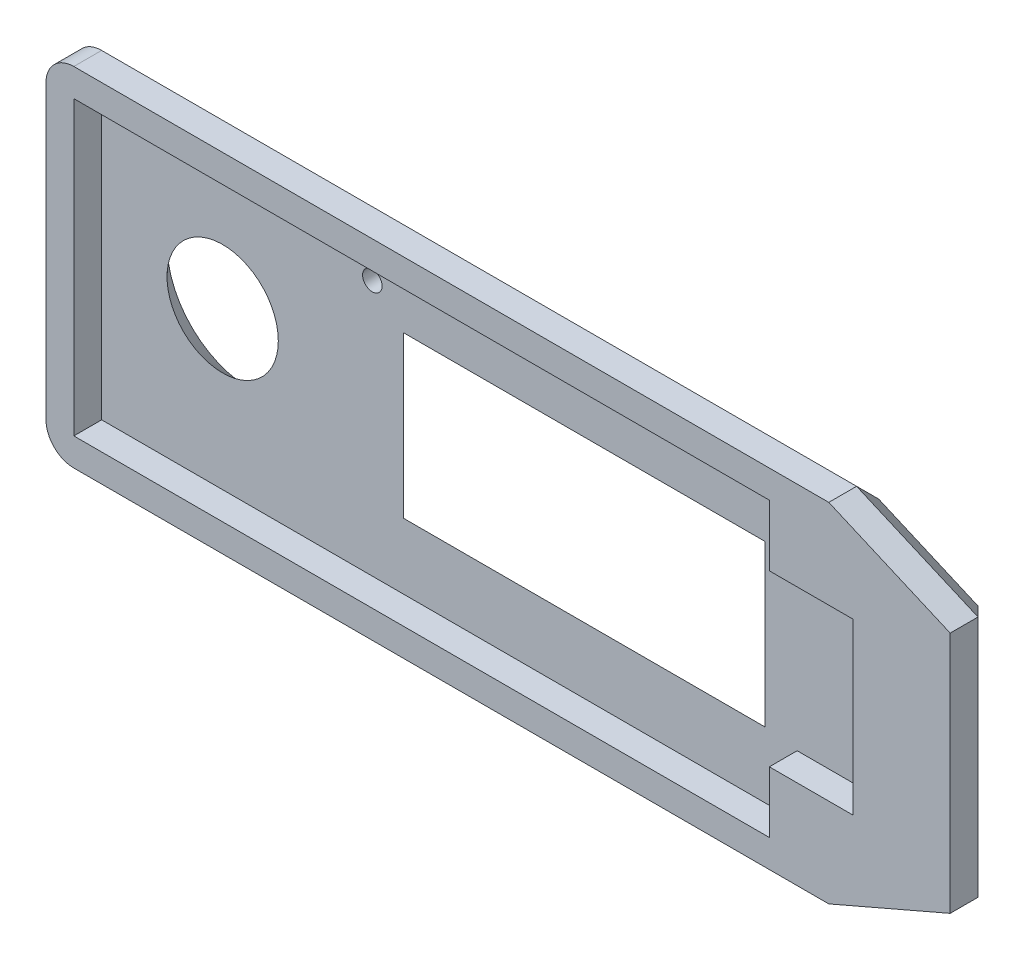
ISO-10303-21;
HEADER;
FILE_DESCRIPTION(('STEP AP214'),'2;1');
FILE_NAME('part.step','',(''),(''),'','','');
FILE_SCHEMA(('AUTOMOTIVE_DESIGN { 1 0 10303 214 1 1 1 1 }'));
ENDSEC;
DATA;
#1=APPLICATION_CONTEXT('core data for automotive mechanical design processes');
#2=APPLICATION_PROTOCOL_DEFINITION('international standard','automotive_design',2000,#1);
#3=PRODUCT_CONTEXT('',#1,'mechanical');
#4=PRODUCT('Part','Part','',(#3));
#5=PRODUCT_RELATED_PRODUCT_CATEGORY('part','',(#4));
#6=PRODUCT_DEFINITION_FORMATION('','',#4);
#7=PRODUCT_DEFINITION_CONTEXT('part definition',#1,'design');
#8=PRODUCT_DEFINITION('design','',#6,#7);
#9=PRODUCT_DEFINITION_SHAPE('','',#8);
#10=(LENGTH_UNIT() NAMED_UNIT(*) SI_UNIT(.MILLI.,.METRE.));
#11=(NAMED_UNIT(*) PLANE_ANGLE_UNIT() SI_UNIT($,.RADIAN.));
#12=(NAMED_UNIT(*) SI_UNIT($,.STERADIAN.) SOLID_ANGLE_UNIT());
#13=UNCERTAINTY_MEASURE_WITH_UNIT(LENGTH_MEASURE(1.E-05),#10,'distance_accuracy_value','');
#14=(GEOMETRIC_REPRESENTATION_CONTEXT(3) GLOBAL_UNCERTAINTY_ASSIGNED_CONTEXT((#13)) GLOBAL_UNIT_ASSIGNED_CONTEXT((#10,
#11,#12)) REPRESENTATION_CONTEXT('',''));
#15=CARTESIAN_POINT('',(0.,0.,0.));
#16=DIRECTION('',(0.,0.,1.));
#17=DIRECTION('',(1.,0.,0.));
#18=AXIS2_PLACEMENT_3D('',#15,#16,#17);
#19=CARTESIAN_POINT('',(-18.703125,13.70078125,2.));
#20=DIRECTION('',(1.,0.,0.));
#21=DIRECTION('',(0.,1.,0.));
#22=AXIS2_PLACEMENT_3D('',#19,#20,#21);
#23=PLANE('',#22);
#24=DIRECTION('',(0.,0.,-1.));
#25=VECTOR('',#24,1.);
#26=CARTESIAN_POINT('',(-18.703125,11.70078125,2.));
#27=LINE('',#26,#25);
#28=CARTESIAN_POINT('',(-18.703125,11.70078125,4.));
#29=VERTEX_POINT('',#28);
#30=CARTESIAN_POINT('',(-18.703125,11.70078125,2.00000000000001));
#31=VERTEX_POINT('',#30);
#32=EDGE_CURVE('E242',#29,#31,#27,.T.);
#33=ORIENTED_EDGE('',*,*,#32,.T.);
#34=DIRECTION('',(0.,-1.,0.));
#35=VECTOR('',#34,1.);
#36=CARTESIAN_POINT('',(-18.703125,13.70078125,2.));
#37=LINE('',#36,#35);
#38=CARTESIAN_POINT('',(-18.703125,-9.29921875,2.));
#39=VERTEX_POINT('',#38);
#40=EDGE_CURVE('E266',#31,#39,#37,.T.);
#41=ORIENTED_EDGE('',*,*,#40,.T.);
#42=DIRECTION('',(0.,0.,-1.));
#43=VECTOR('',#42,1.);
#44=CARTESIAN_POINT('',(-18.703125,-9.29921875,2.));
#45=LINE('',#44,#43);
#46=CARTESIAN_POINT('',(-18.703125,-9.29921875,4.));
#47=VERTEX_POINT('',#46);
#48=EDGE_CURVE('E245',#39,#47,#45,.F.);
#49=ORIENTED_EDGE('',*,*,#48,.T.);
#50=DIRECTION('',(0.,-1.,0.));
#51=VECTOR('',#50,1.);
#52=CARTESIAN_POINT('',(-18.703125,13.70078125,4.));
#53=LINE('',#52,#51);
#54=EDGE_CURVE('E384',#29,#47,#53,.T.);
#55=ORIENTED_EDGE('',*,*,#54,.F.);
#56=EDGE_LOOP('',(#33,#41,#49,#55));
#57=FACE_BOUND('',#56,.T.);
#58=ADVANCED_FACE('F35',(#57),#23,.F.);
#59=CARTESIAN_POINT('',(-18.703125,-11.29921875,2.));
#60=DIRECTION('',(0.,1.,0.));
#61=DIRECTION('',(-1.,0.,0.));
#62=AXIS2_PLACEMENT_3D('',#59,#60,#61);
#63=PLANE('',#62);
#64=DIRECTION('',(0.,0.,-1.));
#65=VECTOR('',#64,1.);
#66=CARTESIAN_POINT('',(-16.703125,-11.29921875,2.));
#67=LINE('',#66,#65);
#68=CARTESIAN_POINT('',(-16.703125,-11.29921875,4.));
#69=VERTEX_POINT('',#68);
#70=CARTESIAN_POINT('',(-16.703125,-11.29921875,2.00000000000001));
#71=VERTEX_POINT('',#70);
#72=EDGE_CURVE('E239',#69,#71,#67,.T.);
#73=ORIENTED_EDGE('',*,*,#72,.T.);
#74=DIRECTION('',(1.,0.,0.));
#75=VECTOR('',#74,1.);
#76=CARTESIAN_POINT('',(-18.703125,-11.29921875,2.));
#77=LINE('',#76,#75);
#78=CARTESIAN_POINT('',(37.5703125,-11.29921875,2.));
#79=VERTEX_POINT('',#78);
#80=EDGE_CURVE('E253',#71,#79,#77,.T.);
#81=ORIENTED_EDGE('',*,*,#80,.T.);
#82=DIRECTION('',(0.,0.,-1.));
#83=VECTOR('',#82,1.);
#84=CARTESIAN_POINT('',(37.5703125,-11.29921875,2.));
#85=LINE('',#84,#83);
#86=CARTESIAN_POINT('',(37.5703125,-11.29921875,4.));
#87=VERTEX_POINT('',#86);
#88=EDGE_CURVE('E409',#87,#79,#85,.T.);
#89=ORIENTED_EDGE('',*,*,#88,.F.);
#90=DIRECTION('',(1.,0.,0.));
#91=VECTOR('',#90,1.);
#92=CARTESIAN_POINT('',(-18.703125,-11.29921875,4.));
#93=LINE('',#92,#91);
#94=EDGE_CURVE('E387',#69,#87,#93,.T.);
#95=ORIENTED_EDGE('',*,*,#94,.F.);
#96=EDGE_LOOP('',(#73,#81,#89,#95));
#97=FACE_BOUND('',#96,.T.);
#98=ADVANCED_FACE('F440',(#97),#63,.F.);
#99=CARTESIAN_POINT('',(46.296875,-7.52421874999999,2.));
#100=DIRECTION('',(-0.397030883570598,0.91780525030703,0.));
#101=DIRECTION('',(-0.91780525030703,-0.397030883570598,0.));
#102=AXIS2_PLACEMENT_3D('',#99,#100,#101);
#103=PLANE('',#102);
#104=ORIENTED_EDGE('',*,*,#88,.T.);
#105=DIRECTION('',(0.91780525030703,0.397030883570598,0.));
#106=VECTOR('',#105,1.);
#107=CARTESIAN_POINT('',(46.296875,-7.52421874999999,2.));
#108=LINE('',#107,#106);
#109=CARTESIAN_POINT('',(46.296875,-7.52421874999999,2.));
#110=VERTEX_POINT('',#109);
#111=EDGE_CURVE('E303',#79,#110,#108,.T.);
#112=ORIENTED_EDGE('',*,*,#111,.T.);
#113=DIRECTION('',(0.,0.,-1.));
#114=VECTOR('',#113,1.);
#115=CARTESIAN_POINT('',(46.296875,-7.52421874999999,2.));
#116=LINE('',#115,#114);
#117=CARTESIAN_POINT('',(46.296875,-7.52421874999999,4.));
#118=VERTEX_POINT('',#117);
#119=EDGE_CURVE('E406',#118,#110,#116,.T.);
#120=ORIENTED_EDGE('',*,*,#119,.F.);
#121=DIRECTION('',(0.91780525030703,0.397030883570598,0.));
#122=VECTOR('',#121,1.);
#123=CARTESIAN_POINT('',(37.5703125,-11.29921875,4.));
#124=LINE('',#123,#122);
#125=EDGE_CURVE('E389',#87,#118,#124,.T.);
#126=ORIENTED_EDGE('',*,*,#125,.F.);
#127=EDGE_LOOP('',(#104,#112,#120,#126));
#128=FACE_BOUND('',#127,.T.);
#129=ADVANCED_FACE('F462',(#128),#103,.F.);
#130=CARTESIAN_POINT('',(46.296875,9.92578124999999,2.));
#131=DIRECTION('',(-1.,0.,0.));
#132=DIRECTION('',(0.,0.,1.));
#133=AXIS2_PLACEMENT_3D('',#130,#131,#132);
#134=PLANE('',#133);
#135=ORIENTED_EDGE('',*,*,#119,.T.);
#136=DIRECTION('',(0.,1.,0.));
#137=VECTOR('',#136,1.);
#138=CARTESIAN_POINT('',(46.296875,9.92578124999999,2.));
#139=LINE('',#138,#137);
#140=CARTESIAN_POINT('',(46.296875,9.92578124999999,2.));
#141=VERTEX_POINT('',#140);
#142=EDGE_CURVE('E300',#110,#141,#139,.T.);
#143=ORIENTED_EDGE('',*,*,#142,.T.);
#144=DIRECTION('',(0.,0.,-1.));
#145=VECTOR('',#144,1.);
#146=CARTESIAN_POINT('',(46.296875,9.92578124999999,2.));
#147=LINE('',#146,#145);
#148=CARTESIAN_POINT('',(46.296875,9.92578124999999,4.));
#149=VERTEX_POINT('',#148);
#150=EDGE_CURVE('E403',#149,#141,#147,.T.);
#151=ORIENTED_EDGE('',*,*,#150,.F.);
#152=DIRECTION('',(0.,1.,0.));
#153=VECTOR('',#152,1.);
#154=CARTESIAN_POINT('',(46.296875,-7.52421874999999,4.));
#155=LINE('',#154,#153);
#156=EDGE_CURVE('E392',#118,#149,#155,.T.);
#157=ORIENTED_EDGE('',*,*,#156,.F.);
#158=EDGE_LOOP('',(#135,#143,#151,#157));
#159=FACE_BOUND('',#158,.T.);
#160=ADVANCED_FACE('F458',(#159),#134,.F.);
#161=CARTESIAN_POINT('',(46.296875,9.92578124999999,2.));
#162=DIRECTION('',(-0.397030883570599,-0.91780525030703,0.));
#163=DIRECTION('',(0.91780525030703,-0.397030883570599,0.));
#164=AXIS2_PLACEMENT_3D('',#161,#162,#163);
#165=PLANE('',#164);
#166=ORIENTED_EDGE('',*,*,#150,.T.);
#167=DIRECTION('',(-0.91780525030703,0.397030883570599,0.));
#168=VECTOR('',#167,1.);
#169=CARTESIAN_POINT('',(46.296875,9.92578124999999,2.));
#170=LINE('',#169,#168);
#171=CARTESIAN_POINT('',(37.5703125,13.70078125,2.));
#172=VERTEX_POINT('',#171);
#173=EDGE_CURVE('E412',#141,#172,#170,.T.);
#174=ORIENTED_EDGE('',*,*,#173,.T.);
#175=DIRECTION('',(0.,0.,-1.));
#176=VECTOR('',#175,1.);
#177=CARTESIAN_POINT('',(37.5703125,13.70078125,2.));
#178=LINE('',#177,#176);
#179=CARTESIAN_POINT('',(37.5703125,13.70078125,4.));
#180=VERTEX_POINT('',#179);
#181=EDGE_CURVE('E401',#180,#172,#178,.T.);
#182=ORIENTED_EDGE('',*,*,#181,.F.);
#183=DIRECTION('',(-0.91780525030703,0.397030883570599,0.));
#184=VECTOR('',#183,1.);
#185=CARTESIAN_POINT('',(46.296875,9.92578124999999,4.));
#186=LINE('',#185,#184);
#187=EDGE_CURVE('E395',#149,#180,#186,.T.);
#188=ORIENTED_EDGE('',*,*,#187,.F.);
#189=EDGE_LOOP('',(#166,#174,#182,#188));
#190=FACE_BOUND('',#189,.T.);
#191=ADVANCED_FACE('F455',(#190),#165,.F.);
#192=CARTESIAN_POINT('',(-18.703125,13.70078125,2.));
#193=DIRECTION('',(0.,-1.,0.));
#194=DIRECTION('',(1.,0.,0.));
#195=AXIS2_PLACEMENT_3D('',#192,#193,#194);
#196=PLANE('',#195);
#197=ORIENTED_EDGE('',*,*,#181,.T.);
#198=DIRECTION('',(-1.,0.,0.));
#199=VECTOR('',#198,1.);
#200=CARTESIAN_POINT('',(-18.703125,13.70078125,2.));
#201=LINE('',#200,#199);
#202=CARTESIAN_POINT('',(-16.703125,13.70078125,2.));
#203=VERTEX_POINT('',#202);
#204=EDGE_CURVE('E45',#172,#203,#201,.T.);
#205=ORIENTED_EDGE('',*,*,#204,.T.);
#206=DIRECTION('',(0.,0.,-1.));
#207=VECTOR('',#206,1.);
#208=CARTESIAN_POINT('',(-16.703125,13.70078125,2.));
#209=LINE('',#208,#207);
#210=CARTESIAN_POINT('',(-16.703125,13.70078125,4.));
#211=VERTEX_POINT('',#210);
#212=EDGE_CURVE('E251',#203,#211,#209,.F.);
#213=ORIENTED_EDGE('',*,*,#212,.T.);
#214=DIRECTION('',(-1.,0.,0.));
#215=VECTOR('',#214,1.);
#216=CARTESIAN_POINT('',(37.5703125,13.70078125,4.));
#217=LINE('',#216,#215);
#218=EDGE_CURVE('E398',#180,#211,#217,.T.);
#219=ORIENTED_EDGE('',*,*,#218,.F.);
#220=EDGE_LOOP('',(#197,#205,#213,#219));
#221=FACE_BOUND('',#220,.T.);
#222=ADVANCED_FACE('F452',(#221),#196,.F.);
#223=CARTESIAN_POINT('',(0.,0.,0.));
#224=DIRECTION('',(0.,0.,1.));
#225=DIRECTION('',(1.,0.,0.));
#226=AXIS2_PLACEMENT_3D('',#223,#224,#225);
#227=PLANE('',#226);
#228=CARTESIAN_POINT('',(-8.00312499999999,1.96785344968988,0.));
#229=DIRECTION('',(0.,0.,1.));
#230=DIRECTION('',(1.,0.,0.));
#231=AXIS2_PLACEMENT_3D('',#228,#229,#230);
#232=CIRCLE('',#231,6.);
#233=CARTESIAN_POINT('',(-2.00312499999999,1.96785344968988,0.));
#234=VERTEX_POINT('',#233);
#235=EDGE_CURVE('E421',#234,#234,#232,.T.);
#236=ORIENTED_EDGE('',*,*,#235,.T.);
#237=EDGE_LOOP('',(#236));
#238=FACE_BOUND('',#237,.T.);
#239=CARTESIAN_POINT('',(2.75687500000002,9.10078125,0.));
#240=DIRECTION('',(0.,0.,1.));
#241=DIRECTION('',(1.,0.,0.));
#242=AXIS2_PLACEMENT_3D('',#239,#240,#241);
#243=CIRCLE('',#242,0.7);
#244=CARTESIAN_POINT('',(3.44562386569782,8.97578125000001,0.));
#245=VERTEX_POINT('',#244);
#246=CARTESIAN_POINT('',(2.99687500000001,8.44320996108906,0.));
#247=VERTEX_POINT('',#246);
#248=EDGE_CURVE('E318',#245,#247,#243,.T.);
#249=ORIENTED_EDGE('',*,*,#248,.T.);
#250=DIRECTION('',(0.,-1.,0.));
#251=VECTOR('',#250,1.);
#252=CARTESIAN_POINT('',(2.99687500000001,0.,0.));
#253=LINE('',#252,#251);
#254=CARTESIAN_POINT('',(2.99687500000002,-6.57421875,0.));
#255=VERTEX_POINT('',#254);
#256=EDGE_CURVE('E419',#247,#255,#253,.T.);
#257=ORIENTED_EDGE('',*,*,#256,.T.);
#258=DIRECTION('',(1.,0.,0.));
#259=VECTOR('',#258,1.);
#260=CARTESIAN_POINT('',(0.,-6.57421875,0.));
#261=LINE('',#260,#259);
#262=CARTESIAN_POINT('',(32.996875,-6.57421875,0.));
#263=VERTEX_POINT('',#262);
#264=EDGE_CURVE('E417',#255,#263,#261,.T.);
#265=ORIENTED_EDGE('',*,*,#264,.T.);
#266=DIRECTION('',(0.,1.,0.));
#267=VECTOR('',#266,1.);
#268=CARTESIAN_POINT('',(32.996875,0.,0.));
#269=LINE('',#268,#267);
#270=CARTESIAN_POINT('',(32.996875,8.97578125000001,0.));
#271=VERTEX_POINT('',#270);
#272=EDGE_CURVE('E415',#263,#271,#269,.T.);
#273=ORIENTED_EDGE('',*,*,#272,.T.);
#274=DIRECTION('',(-1.,0.,0.));
#275=VECTOR('',#274,1.);
#276=CARTESIAN_POINT('',(0.,8.97578125000001,0.));
#277=LINE('',#276,#275);
#278=EDGE_CURVE('E223',#271,#245,#277,.T.);
#279=ORIENTED_EDGE('',*,*,#278,.T.);
#280=EDGE_LOOP('',(#249,#257,#265,#273,#279));
#281=FACE_BOUND('',#280,.T.);
#282=DIRECTION('',(-0.91780525030703,-0.397030883570598,0.));
#283=VECTOR('',#282,1.);
#284=CARTESIAN_POINT('',(9.24568068188183,-21.3729828676779,0.));
#285=LINE('',#284,#283);
#286=CARTESIAN_POINT('',(44.296875,-6.21028179828241,0.));
#287=VERTEX_POINT('',#286);
#288=CARTESIAN_POINT('',(37.1562653661662,-9.29921874999999,0.));
#289=VERTEX_POINT('',#288);
#290=EDGE_CURVE('E305',#287,#289,#285,.T.);
#291=ORIENTED_EDGE('',*,*,#290,.T.);
#292=DIRECTION('',(-1.,0.,0.));
#293=VECTOR('',#292,1.);
#294=CARTESIAN_POINT('',(0.,-9.29921874999998,0.));
#295=LINE('',#294,#293);
#296=CARTESIAN_POINT('',(-16.703125,-9.29921875,0.));
#297=VERTEX_POINT('',#296);
#298=EDGE_CURVE('E262',#289,#297,#295,.T.);
#299=ORIENTED_EDGE('',*,*,#298,.T.);
#300=DIRECTION('',(0.,1.,0.));
#301=VECTOR('',#300,1.);
#302=CARTESIAN_POINT('',(-16.703125,0.,0.));
#303=LINE('',#302,#301);
#304=CARTESIAN_POINT('',(-16.703125,11.70078125,0.));
#305=VERTEX_POINT('',#304);
#306=EDGE_CURVE('E260',#297,#305,#303,.T.);
#307=ORIENTED_EDGE('',*,*,#306,.T.);
#308=DIRECTION('',(1.,0.,0.));
#309=VECTOR('',#308,1.);
#310=CARTESIAN_POINT('',(0.,11.70078125,0.));
#311=LINE('',#310,#309);
#312=CARTESIAN_POINT('',(37.1562653661661,11.70078125,0.));
#313=VERTEX_POINT('',#312);
#314=EDGE_CURVE('E258',#305,#313,#311,.T.);
#315=ORIENTED_EDGE('',*,*,#314,.T.);
#316=DIRECTION('',(0.91780525030703,-0.397030883570599,0.));
#317=VECTOR('',#316,1.);
#318=CARTESIAN_POINT('',(10.1208029229807,23.3959786112778,0.));
#319=LINE('',#318,#317);
#320=CARTESIAN_POINT('',(44.296875,8.61184429828241,0.));
#321=VERTEX_POINT('',#320);
#322=EDGE_CURVE('E292',#313,#321,#319,.T.);
#323=ORIENTED_EDGE('',*,*,#322,.T.);
#324=DIRECTION('',(0.,-1.,0.));
#325=VECTOR('',#324,1.);
#326=CARTESIAN_POINT('',(44.296875,0.,0.));
#327=LINE('',#326,#325);
#328=EDGE_CURVE('E301',#321,#287,#327,.T.);
#329=ORIENTED_EDGE('',*,*,#328,.T.);
#330=EDGE_LOOP('',(#291,#299,#307,#315,#323,#329));
#331=FACE_BOUND('',#330,.T.);
#332=ADVANCED_FACE('F291',(#238,#281,#331),#227,.F.);
#333=CARTESIAN_POINT('',(0.,0.,4.));
#334=DIRECTION('',(0.,0.,1.));
#335=DIRECTION('',(1.,0.,0.));
#336=AXIS2_PLACEMENT_3D('',#333,#334,#335);
#337=PLANE('',#336);
#338=ORIENTED_EDGE('',*,*,#54,.T.);
#339=CARTESIAN_POINT('',(-16.703125,-9.29921875,4.));
#340=DIRECTION('',(0.,0.,1.));
#341=DIRECTION('',(1.,0.,0.));
#342=AXIS2_PLACEMENT_3D('',#339,#340,#341);
#343=CIRCLE('',#342,2.);
#344=EDGE_CURVE('E249',#47,#69,#343,.T.);
#345=ORIENTED_EDGE('',*,*,#344,.T.);
#346=ORIENTED_EDGE('',*,*,#94,.T.);
#347=ORIENTED_EDGE('',*,*,#125,.T.);
#348=ORIENTED_EDGE('',*,*,#156,.T.);
#349=ORIENTED_EDGE('',*,*,#187,.T.);
#350=ORIENTED_EDGE('',*,*,#218,.T.);
#351=CARTESIAN_POINT('',(-16.703125,11.70078125,4.));
#352=DIRECTION('',(0.,0.,1.));
#353=DIRECTION('',(1.,0.,0.));
#354=AXIS2_PLACEMENT_3D('',#351,#352,#353);
#355=CIRCLE('',#354,2.);
#356=EDGE_CURVE('E247',#211,#29,#355,.T.);
#357=ORIENTED_EDGE('',*,*,#356,.T.);
#358=EDGE_LOOP('',(#338,#345,#346,#347,#348,#349,#350,#357));
#359=FACE_BOUND('',#358,.T.);
#360=DIRECTION('',(1.,0.,0.));
#361=VECTOR('',#360,1.);
#362=CARTESIAN_POINT('',(-16.703125,-9.29921875,4.));
#363=LINE('',#362,#361);
#364=CARTESIAN_POINT('',(-16.703125,-9.29921875,4.));
#365=VERTEX_POINT('',#364);
#366=CARTESIAN_POINT('',(33.296875,-9.29921875,4.));
#367=VERTEX_POINT('',#366);
#368=EDGE_CURVE('E328',#365,#367,#363,.T.);
#369=ORIENTED_EDGE('',*,*,#368,.F.);
#370=DIRECTION('',(0.,-1.,0.));
#371=VECTOR('',#370,1.);
#372=CARTESIAN_POINT('',(-16.703125,11.70078125,4.));
#373=LINE('',#372,#371);
#374=CARTESIAN_POINT('',(-16.703125,11.70078125,4.));
#375=VERTEX_POINT('',#374);
#376=EDGE_CURVE('E326',#375,#365,#373,.T.);
#377=ORIENTED_EDGE('',*,*,#376,.F.);
#378=DIRECTION('',(-1.,0.,0.));
#379=VECTOR('',#378,1.);
#380=CARTESIAN_POINT('',(-16.703125,11.70078125,4.));
#381=LINE('',#380,#379);
#382=CARTESIAN_POINT('',(33.296875,11.70078125,4.));
#383=VERTEX_POINT('',#382);
#384=EDGE_CURVE('E342',#383,#375,#381,.T.);
#385=ORIENTED_EDGE('',*,*,#384,.F.);
#386=DIRECTION('',(0.,1.,0.));
#387=VECTOR('',#386,1.);
#388=CARTESIAN_POINT('',(33.296875,11.70078125,4.));
#389=LINE('',#388,#387);
#390=CARTESIAN_POINT('',(33.296875,7.30078125,4.));
#391=VERTEX_POINT('',#390);
#392=EDGE_CURVE('E339',#391,#383,#389,.T.);
#393=ORIENTED_EDGE('',*,*,#392,.F.);
#394=DIRECTION('',(-1.,0.,0.));
#395=VECTOR('',#394,1.);
#396=CARTESIAN_POINT('',(39.296875,7.30078125,4.));
#397=LINE('',#396,#395);
#398=CARTESIAN_POINT('',(39.296875,7.30078125,4.));
#399=VERTEX_POINT('',#398);
#400=EDGE_CURVE('E337',#399,#391,#397,.T.);
#401=ORIENTED_EDGE('',*,*,#400,.F.);
#402=DIRECTION('',(0.,1.,0.));
#403=VECTOR('',#402,1.);
#404=CARTESIAN_POINT('',(39.296875,-4.89921875,4.));
#405=LINE('',#404,#403);
#406=CARTESIAN_POINT('',(39.296875,-4.89921875,4.));
#407=VERTEX_POINT('',#406);
#408=EDGE_CURVE('E335',#407,#399,#405,.T.);
#409=ORIENTED_EDGE('',*,*,#408,.F.);
#410=DIRECTION('',(1.,0.,0.));
#411=VECTOR('',#410,1.);
#412=CARTESIAN_POINT('',(39.296875,-4.89921875,4.));
#413=LINE('',#412,#411);
#414=CARTESIAN_POINT('',(33.296875,-4.89921875,4.));
#415=VERTEX_POINT('',#414);
#416=EDGE_CURVE('E333',#415,#407,#413,.T.);
#417=ORIENTED_EDGE('',*,*,#416,.F.);
#418=DIRECTION('',(0.,1.,0.));
#419=VECTOR('',#418,1.);
#420=CARTESIAN_POINT('',(33.296875,-4.89921875,4.));
#421=LINE('',#420,#419);
#422=EDGE_CURVE('E331',#367,#415,#421,.T.);
#423=ORIENTED_EDGE('',*,*,#422,.F.);
#424=EDGE_LOOP('',(#369,#377,#385,#393,#401,#409,#417,#423));
#425=FACE_BOUND('',#424,.T.);
#426=ADVANCED_FACE('F444',(#359,#425),#337,.T.);
#427=CARTESIAN_POINT('',(-16.703125,11.70078125,4.));
#428=DIRECTION('',(1.,0.,0.));
#429=DIRECTION('',(0.,1.,0.));
#430=AXIS2_PLACEMENT_3D('',#427,#428,#429);
#431=PLANE('',#430);
#432=DIRECTION('',(0.,-1.,0.));
#433=VECTOR('',#432,1.);
#434=CARTESIAN_POINT('',(-16.703125,11.70078125,2.));
#435=LINE('',#434,#433);
#436=CARTESIAN_POINT('',(-16.703125,11.70078125,2.));
#437=VERTEX_POINT('',#436);
#438=CARTESIAN_POINT('',(-16.703125,-9.29921875,2.));
#439=VERTEX_POINT('',#438);
#440=EDGE_CURVE('E345',#437,#439,#435,.T.);
#441=ORIENTED_EDGE('',*,*,#440,.F.);
#442=DIRECTION('',(0.,0.,-1.));
#443=VECTOR('',#442,1.);
#444=CARTESIAN_POINT('',(-16.703125,11.70078125,4.));
#445=LINE('',#444,#443);
#446=EDGE_CURVE('E344',#375,#437,#445,.T.);
#447=ORIENTED_EDGE('',*,*,#446,.F.);
#448=ORIENTED_EDGE('',*,*,#376,.T.);
#449=DIRECTION('',(0.,0.,-1.));
#450=VECTOR('',#449,1.);
#451=CARTESIAN_POINT('',(-16.703125,-9.29921875,4.));
#452=LINE('',#451,#450);
#453=EDGE_CURVE('E381',#365,#439,#452,.T.);
#454=ORIENTED_EDGE('',*,*,#453,.T.);
#455=EDGE_LOOP('',(#441,#447,#448,#454));
#456=FACE_BOUND('',#455,.T.);
#457=ADVANCED_FACE('F661',(#456),#431,.T.);
#458=CARTESIAN_POINT('',(-16.703125,-9.29921875,4.));
#459=DIRECTION('',(0.,1.,0.));
#460=DIRECTION('',(0.,0.,1.));
#461=AXIS2_PLACEMENT_3D('',#458,#459,#460);
#462=PLANE('',#461);
#463=DIRECTION('',(1.,0.,0.));
#464=VECTOR('',#463,1.);
#465=CARTESIAN_POINT('',(-16.703125,-9.29921875,2.));
#466=LINE('',#465,#464);
#467=CARTESIAN_POINT('',(33.296875,-9.29921875,2.));
#468=VERTEX_POINT('',#467);
#469=EDGE_CURVE('E347',#439,#468,#466,.T.);
#470=ORIENTED_EDGE('',*,*,#469,.F.);
#471=ORIENTED_EDGE('',*,*,#453,.F.);
#472=ORIENTED_EDGE('',*,*,#368,.T.);
#473=DIRECTION('',(0.,0.,-1.));
#474=VECTOR('',#473,1.);
#475=CARTESIAN_POINT('',(33.296875,-9.29921875,4.));
#476=LINE('',#475,#474);
#477=EDGE_CURVE('E378',#367,#468,#476,.T.);
#478=ORIENTED_EDGE('',*,*,#477,.T.);
#479=EDGE_LOOP('',(#470,#471,#472,#478));
#480=FACE_BOUND('',#479,.T.);
#481=ADVANCED_FACE('F653',(#480),#462,.T.);
#482=CARTESIAN_POINT('',(33.296875,-4.89921875,4.));
#483=DIRECTION('',(-1.,0.,0.));
#484=DIRECTION('',(0.,0.,1.));
#485=AXIS2_PLACEMENT_3D('',#482,#483,#484);
#486=PLANE('',#485);
#487=DIRECTION('',(0.,1.,0.));
#488=VECTOR('',#487,1.);
#489=CARTESIAN_POINT('',(33.296875,-4.89921875,2.));
#490=LINE('',#489,#488);
#491=CARTESIAN_POINT('',(33.296875,-4.89921875,2.));
#492=VERTEX_POINT('',#491);
#493=EDGE_CURVE('E350',#468,#492,#490,.T.);
#494=ORIENTED_EDGE('',*,*,#493,.F.);
#495=ORIENTED_EDGE('',*,*,#477,.F.);
#496=ORIENTED_EDGE('',*,*,#422,.T.);
#497=DIRECTION('',(0.,0.,-1.));
#498=VECTOR('',#497,1.);
#499=CARTESIAN_POINT('',(33.296875,-4.89921875,4.));
#500=LINE('',#499,#498);
#501=EDGE_CURVE('E375',#415,#492,#500,.T.);
#502=ORIENTED_EDGE('',*,*,#501,.T.);
#503=EDGE_LOOP('',(#494,#495,#496,#502));
#504=FACE_BOUND('',#503,.T.);
#505=ADVANCED_FACE('F645',(#504),#486,.T.);
#506=CARTESIAN_POINT('',(39.296875,-4.89921875,4.));
#507=DIRECTION('',(0.,1.,0.));
#508=DIRECTION('',(-1.,0.,0.));
#509=AXIS2_PLACEMENT_3D('',#506,#507,#508);
#510=PLANE('',#509);
#511=DIRECTION('',(1.,0.,0.));
#512=VECTOR('',#511,1.);
#513=CARTESIAN_POINT('',(39.296875,-4.89921875,2.));
#514=LINE('',#513,#512);
#515=CARTESIAN_POINT('',(39.296875,-4.89921875,2.));
#516=VERTEX_POINT('',#515);
#517=EDGE_CURVE('E352',#492,#516,#514,.T.);
#518=ORIENTED_EDGE('',*,*,#517,.F.);
#519=ORIENTED_EDGE('',*,*,#501,.F.);
#520=ORIENTED_EDGE('',*,*,#416,.T.);
#521=DIRECTION('',(0.,0.,-1.));
#522=VECTOR('',#521,1.);
#523=CARTESIAN_POINT('',(39.296875,-4.89921875,4.));
#524=LINE('',#523,#522);
#525=EDGE_CURVE('E372',#407,#516,#524,.T.);
#526=ORIENTED_EDGE('',*,*,#525,.T.);
#527=EDGE_LOOP('',(#518,#519,#520,#526));
#528=FACE_BOUND('',#527,.T.);
#529=ADVANCED_FACE('F637',(#528),#510,.T.);
#530=CARTESIAN_POINT('',(39.296875,-4.89921875,4.));
#531=DIRECTION('',(-1.,0.,0.));
#532=DIRECTION('',(0.,-1.,0.));
#533=AXIS2_PLACEMENT_3D('',#530,#531,#532);
#534=PLANE('',#533);
#535=DIRECTION('',(0.,1.,0.));
#536=VECTOR('',#535,1.);
#537=CARTESIAN_POINT('',(39.296875,-4.89921875,2.));
#538=LINE('',#537,#536);
#539=CARTESIAN_POINT('',(39.296875,7.30078125,2.));
#540=VERTEX_POINT('',#539);
#541=EDGE_CURVE('E354',#516,#540,#538,.T.);
#542=ORIENTED_EDGE('',*,*,#541,.F.);
#543=ORIENTED_EDGE('',*,*,#525,.F.);
#544=ORIENTED_EDGE('',*,*,#408,.T.);
#545=DIRECTION('',(0.,0.,-1.));
#546=VECTOR('',#545,1.);
#547=CARTESIAN_POINT('',(39.296875,7.30078125,4.));
#548=LINE('',#547,#546);
#549=EDGE_CURVE('E369',#399,#540,#548,.T.);
#550=ORIENTED_EDGE('',*,*,#549,.T.);
#551=EDGE_LOOP('',(#542,#543,#544,#550));
#552=FACE_BOUND('',#551,.T.);
#553=ADVANCED_FACE('F629',(#552),#534,.T.);
#554=CARTESIAN_POINT('',(39.296875,7.30078125,4.));
#555=DIRECTION('',(0.,-1.,0.));
#556=DIRECTION('',(1.,0.,0.));
#557=AXIS2_PLACEMENT_3D('',#554,#555,#556);
#558=PLANE('',#557);
#559=DIRECTION('',(-1.,0.,0.));
#560=VECTOR('',#559,1.);
#561=CARTESIAN_POINT('',(39.296875,7.30078125,2.));
#562=LINE('',#561,#560);
#563=CARTESIAN_POINT('',(33.296875,7.30078125,2.));
#564=VERTEX_POINT('',#563);
#565=EDGE_CURVE('E356',#540,#564,#562,.T.);
#566=ORIENTED_EDGE('',*,*,#565,.F.);
#567=ORIENTED_EDGE('',*,*,#549,.F.);
#568=ORIENTED_EDGE('',*,*,#400,.T.);
#569=DIRECTION('',(0.,0.,-1.));
#570=VECTOR('',#569,1.);
#571=CARTESIAN_POINT('',(33.296875,7.30078125,4.));
#572=LINE('',#571,#570);
#573=EDGE_CURVE('E366',#391,#564,#572,.T.);
#574=ORIENTED_EDGE('',*,*,#573,.T.);
#575=EDGE_LOOP('',(#566,#567,#568,#574));
#576=FACE_BOUND('',#575,.T.);
#577=ADVANCED_FACE('F621',(#576),#558,.T.);
#578=CARTESIAN_POINT('',(33.296875,11.70078125,4.));
#579=DIRECTION('',(-1.,0.,0.));
#580=DIRECTION('',(0.,0.,1.));
#581=AXIS2_PLACEMENT_3D('',#578,#579,#580);
#582=PLANE('',#581);
#583=DIRECTION('',(0.,1.,0.));
#584=VECTOR('',#583,1.);
#585=CARTESIAN_POINT('',(33.296875,11.70078125,2.));
#586=LINE('',#585,#584);
#587=CARTESIAN_POINT('',(33.296875,11.70078125,2.));
#588=VERTEX_POINT('',#587);
#589=EDGE_CURVE('E358',#564,#588,#586,.T.);
#590=ORIENTED_EDGE('',*,*,#589,.F.);
#591=ORIENTED_EDGE('',*,*,#573,.F.);
#592=ORIENTED_EDGE('',*,*,#392,.T.);
#593=DIRECTION('',(0.,0.,-1.));
#594=VECTOR('',#593,1.);
#595=CARTESIAN_POINT('',(33.296875,11.70078125,4.));
#596=LINE('',#595,#594);
#597=EDGE_CURVE('E363',#383,#588,#596,.T.);
#598=ORIENTED_EDGE('',*,*,#597,.T.);
#599=EDGE_LOOP('',(#590,#591,#592,#598));
#600=FACE_BOUND('',#599,.T.);
#601=ADVANCED_FACE('F613',(#600),#582,.T.);
#602=CARTESIAN_POINT('',(-16.703125,11.70078125,4.));
#603=DIRECTION('',(0.,-1.,0.));
#604=DIRECTION('',(0.,0.,-1.));
#605=AXIS2_PLACEMENT_3D('',#602,#603,#604);
#606=PLANE('',#605);
#607=DIRECTION('',(-1.,0.,0.));
#608=VECTOR('',#607,1.);
#609=CARTESIAN_POINT('',(-16.703125,11.70078125,2.));
#610=LINE('',#609,#608);
#611=EDGE_CURVE('E329',#588,#437,#610,.T.);
#612=ORIENTED_EDGE('',*,*,#611,.F.);
#613=ORIENTED_EDGE('',*,*,#597,.F.);
#614=ORIENTED_EDGE('',*,*,#384,.T.);
#615=ORIENTED_EDGE('',*,*,#446,.T.);
#616=EDGE_LOOP('',(#612,#613,#614,#615));
#617=FACE_BOUND('',#616,.T.);
#618=ADVANCED_FACE('F605',(#617),#606,.T.);
#619=CARTESIAN_POINT('',(0.,0.,2.));
#620=DIRECTION('',(0.,0.,1.));
#621=DIRECTION('',(1.,0.,0.));
#622=AXIS2_PLACEMENT_3D('',#619,#620,#621);
#623=PLANE('',#622);
#624=DIRECTION('',(0.,1.,0.));
#625=VECTOR('',#624,1.);
#626=CARTESIAN_POINT('',(30.996875,6.97578125,2.));
#627=LINE('',#626,#625);
#628=CARTESIAN_POINT('',(30.996875,-4.57421875,2.));
#629=VERTEX_POINT('',#628);
#630=CARTESIAN_POINT('',(30.996875,6.97578125,2.));
#631=VERTEX_POINT('',#630);
#632=EDGE_CURVE('E203',#629,#631,#627,.T.);
#633=ORIENTED_EDGE('',*,*,#632,.F.);
#634=DIRECTION('',(1.,0.,0.));
#635=VECTOR('',#634,1.);
#636=CARTESIAN_POINT('',(4.99687500000002,-4.57421875,2.));
#637=LINE('',#636,#635);
#638=CARTESIAN_POINT('',(4.99687500000002,-4.57421875,2.));
#639=VERTEX_POINT('',#638);
#640=EDGE_CURVE('E348',#639,#629,#637,.T.);
#641=ORIENTED_EDGE('',*,*,#640,.F.);
#642=DIRECTION('',(0.,-1.,0.));
#643=VECTOR('',#642,1.);
#644=CARTESIAN_POINT('',(4.99687500000002,6.97578125,2.));
#645=LINE('',#644,#643);
#646=CARTESIAN_POINT('',(4.99687500000002,6.97578125,2.));
#647=VERTEX_POINT('',#646);
#648=EDGE_CURVE('E205',#647,#639,#645,.T.);
#649=ORIENTED_EDGE('',*,*,#648,.F.);
#650=DIRECTION('',(-1.,0.,0.));
#651=VECTOR('',#650,1.);
#652=CARTESIAN_POINT('',(4.99687500000002,6.97578125,2.));
#653=LINE('',#652,#651);
#654=EDGE_CURVE('E199',#631,#647,#653,.T.);
#655=ORIENTED_EDGE('',*,*,#654,.F.);
#656=EDGE_LOOP('',(#633,#641,#649,#655));
#657=FACE_BOUND('',#656,.T.);
#658=CARTESIAN_POINT('',(-8.00312499999999,1.96785344968988,2.));
#659=DIRECTION('',(0.,0.,1.));
#660=DIRECTION('',(1.,0.,0.));
#661=AXIS2_PLACEMENT_3D('',#658,#659,#660);
#662=CIRCLE('',#661,4.);
#663=CARTESIAN_POINT('',(-4.00312499999998,1.96785344968988,2.));
#664=VERTEX_POINT('',#663);
#665=EDGE_CURVE('E219',#664,#664,#662,.T.);
#666=ORIENTED_EDGE('',*,*,#665,.F.);
#667=EDGE_LOOP('',(#666));
#668=FACE_BOUND('',#667,.T.);
#669=CARTESIAN_POINT('',(2.75687500000002,9.10078125,2.));
#670=DIRECTION('',(0.,0.,1.));
#671=DIRECTION('',(1.,0.,0.));
#672=AXIS2_PLACEMENT_3D('',#669,#670,#671);
#673=CIRCLE('',#672,0.7);
#674=CARTESIAN_POINT('',(3.45687500000002,9.10078125,2.));
#675=VERTEX_POINT('',#674);
#676=EDGE_CURVE('E313',#675,#675,#673,.T.);
#677=ORIENTED_EDGE('',*,*,#676,.F.);
#678=EDGE_LOOP('',(#677));
#679=FACE_BOUND('',#678,.T.);
#680=ORIENTED_EDGE('',*,*,#440,.T.);
#681=ORIENTED_EDGE('',*,*,#469,.T.);
#682=ORIENTED_EDGE('',*,*,#493,.T.);
#683=ORIENTED_EDGE('',*,*,#517,.T.);
#684=ORIENTED_EDGE('',*,*,#541,.T.);
#685=ORIENTED_EDGE('',*,*,#565,.T.);
#686=ORIENTED_EDGE('',*,*,#589,.T.);
#687=ORIENTED_EDGE('',*,*,#611,.T.);
#688=EDGE_LOOP('',(#680,#681,#682,#683,#684,#685,#686,#687));
#689=FACE_BOUND('',#688,.T.);
#690=ADVANCED_FACE('F201',(#657,#668,#679,#689),#623,.T.);
#691=CARTESIAN_POINT('',(2.75687500000002,9.10078125,0.));
#692=DIRECTION('',(0.,0.,1.));
#693=DIRECTION('',(1.,0.,0.));
#694=AXIS2_PLACEMENT_3D('',#691,#692,#693);
#695=CYLINDRICAL_SURFACE('',#694,0.7);
#696=CARTESIAN_POINT('',(2.75687500000002,9.10078125,-0.124999999999998));
#697=DIRECTION('',(0.,0.707106781186547,0.707106781186547));
#698=DIRECTION('',(0.,-0.707106781186548,0.707106781186548));
#699=AXIS2_PLACEMENT_3D('',#696,#697,#698);
#700=ELLIPSE('',#699,0.989949493661167,0.7);
#701=CARTESIAN_POINT('',(3.30599858568321,8.66665766431681,0.309123585683198));
#702=VERTEX_POINT('',#701);
#703=EDGE_CURVE('E310',#245,#702,#700,.F.);
#704=ORIENTED_EDGE('',*,*,#703,.T.);
#705=CARTESIAN_POINT('',(2.75687500000002,9.10078125,-0.239999999999993));
#706=DIRECTION('',(-0.707106781186547,0.,0.707106781186547));
#707=DIRECTION('',(0.707106781186548,0.,0.707106781186548));
#708=AXIS2_PLACEMENT_3D('',#705,#706,#707);
#709=ELLIPSE('',#708,0.989949493661167,0.7);
#710=EDGE_CURVE('E243',#702,#247,#709,.F.);
#711=ORIENTED_EDGE('',*,*,#710,.T.);
#712=ORIENTED_EDGE('',*,*,#248,.F.);
#713=EDGE_LOOP('',(#704,#711,#712));
#714=FACE_BOUND('',#713,.T.);
#715=ORIENTED_EDGE('',*,*,#676,.T.);
#716=EDGE_LOOP('',(#715));
#717=FACE_BOUND('',#716,.T.);
#718=ADVANCED_FACE('F493',(#714,#717),#695,.F.);
#719=CARTESIAN_POINT('',(46.296875,-7.52421874999999,2.));
#720=DIRECTION('',(-0.280743230113257,0.648986316300717,0.707106781186548));
#721=DIRECTION('',(0.91780525030703,0.397030883570598,0.));
#722=AXIS2_PLACEMENT_3D('',#719,#720,#721);
#723=PLANE('',#722);
#724=ORIENTED_EDGE('',*,*,#111,.F.);
#725=DIRECTION('',(-0.144844035659171,0.699649985826475,-0.699649985826469));
#726=VECTOR('',#725,1.);
#727=CARTESIAN_POINT('',(37.370835008093,-10.3356690687838,1.03645031878384));
#728=LINE('',#727,#726);
#729=EDGE_CURVE('E256',#79,#289,#728,.T.);
#730=ORIENTED_EDGE('',*,*,#729,.T.);
#731=ORIENTED_EDGE('',*,*,#290,.F.);
#732=DIRECTION('',(0.641288210509641,-0.421306138244728,0.64128821050964));
#733=VECTOR('',#732,1.);
#734=CARTESIAN_POINT('',(46.296875,-7.52421874999999,2.));
#735=LINE('',#734,#733);
#736=EDGE_CURVE('E231',#110,#287,#735,.F.);
#737=ORIENTED_EDGE('',*,*,#736,.F.);
#738=EDGE_LOOP('',(#724,#730,#731,#737));
#739=FACE_BOUND('',#738,.T.);
#740=ADVANCED_FACE('F461',(#739),#723,.F.);
#741=CARTESIAN_POINT('',(46.296875,9.92578124999999,2.));
#742=DIRECTION('',(-0.707106781186547,0.,0.707106781186548));
#743=DIRECTION('',(0.,1.,0.));
#744=AXIS2_PLACEMENT_3D('',#741,#742,#743);
#745=PLANE('',#744);
#746=ORIENTED_EDGE('',*,*,#736,.T.);
#747=ORIENTED_EDGE('',*,*,#328,.F.);
#748=DIRECTION('',(0.641288210509641,0.421306138244729,0.64128821050964));
#749=VECTOR('',#748,1.);
#750=CARTESIAN_POINT('',(46.296875,9.92578124999999,2.));
#751=LINE('',#750,#749);
#752=EDGE_CURVE('E238',#141,#321,#751,.F.);
#753=ORIENTED_EDGE('',*,*,#752,.F.);
#754=ORIENTED_EDGE('',*,*,#142,.F.);
#755=EDGE_LOOP('',(#746,#747,#753,#754));
#756=FACE_BOUND('',#755,.T.);
#757=ADVANCED_FACE('F457',(#756),#745,.F.);
#758=CARTESIAN_POINT('',(46.296875,9.92578124999999,2.));
#759=DIRECTION('',(-0.280743230113257,-0.648986316300716,0.707106781186549));
#760=DIRECTION('',(-0.91780525030703,0.397030883570599,0.));
#761=AXIS2_PLACEMENT_3D('',#758,#759,#760);
#762=PLANE('',#761);
#763=ORIENTED_EDGE('',*,*,#322,.F.);
#764=DIRECTION('',(0.144844035659177,0.699649985826474,0.699649985826469));
#765=VECTOR('',#764,1.);
#766=CARTESIAN_POINT('',(37.370835008093,12.7372315687839,1.03645031878387));
#767=LINE('',#766,#765);
#768=EDGE_CURVE('E11',#313,#172,#767,.T.);
#769=ORIENTED_EDGE('',*,*,#768,.T.);
#770=ORIENTED_EDGE('',*,*,#173,.F.);
#771=ORIENTED_EDGE('',*,*,#752,.T.);
#772=EDGE_LOOP('',(#763,#769,#770,#771));
#773=FACE_BOUND('',#772,.T.);
#774=ADVANCED_FACE('F296',(#773),#762,.F.);
#775=CARTESIAN_POINT('',(-8.00312499999999,1.96785344968988,0.));
#776=DIRECTION('',(0.,0.,-1.));
#777=DIRECTION('',(-1.,0.,0.));
#778=AXIS2_PLACEMENT_3D('',#775,#776,#777);
#779=CONICAL_SURFACE('',#778,6.,0.785398163397447);
#780=ORIENTED_EDGE('',*,*,#665,.T.);
#781=EDGE_LOOP('',(#780));
#782=FACE_BOUND('',#781,.T.);
#783=ORIENTED_EDGE('',*,*,#235,.F.);
#784=EDGE_LOOP('',(#783));
#785=FACE_BOUND('',#784,.T.);
#786=ADVANCED_FACE('F483',(#782,#785),#779,.F.);
#787=CARTESIAN_POINT('',(2.99687500000001,0.,0.));
#788=DIRECTION('',(-0.707106781186547,0.,0.707106781186547));
#789=DIRECTION('',(0.,-1.,0.));
#790=AXIS2_PLACEMENT_3D('',#787,#788,#789);
#791=PLANE('',#790);
#792=DIRECTION('',(0.577350269189626,-0.577350269189626,0.577350269189626));
#793=VECTOR('',#792,1.);
#794=CARTESIAN_POINT('',(1.99791666666668,9.97473958333334,-0.998958333333338));
#795=LINE('',#794,#793);
#796=EDGE_CURVE('E226',#647,#702,#795,.F.);
#797=ORIENTED_EDGE('',*,*,#796,.F.);
#798=ORIENTED_EDGE('',*,*,#648,.T.);
#799=DIRECTION('',(-0.577350269189626,-0.577350269189626,-0.577350269189626));
#800=VECTOR('',#799,1.);
#801=CARTESIAN_POINT('',(1.99791666666668,-7.57317708333334,-0.998958333333338));
#802=LINE('',#801,#800);
#803=EDGE_CURVE('E235',#255,#639,#802,.F.);
#804=ORIENTED_EDGE('',*,*,#803,.F.);
#805=ORIENTED_EDGE('',*,*,#256,.F.);
#806=ORIENTED_EDGE('',*,*,#710,.F.);
#807=EDGE_LOOP('',(#797,#798,#804,#805,#806));
#808=FACE_BOUND('',#807,.T.);
#809=ADVANCED_FACE('F499',(#808),#791,.F.);
#810=CARTESIAN_POINT('',(0.,-6.57421875,0.));
#811=DIRECTION('',(0.,-0.707106781186547,0.707106781186547));
#812=DIRECTION('',(1.,0.,0.));
#813=AXIS2_PLACEMENT_3D('',#810,#811,#812);
#814=PLANE('',#813);
#815=ORIENTED_EDGE('',*,*,#803,.T.);
#816=ORIENTED_EDGE('',*,*,#640,.T.);
#817=DIRECTION('',(0.577350269189626,-0.577350269189626,-0.577350269189626));
#818=VECTOR('',#817,1.);
#819=CARTESIAN_POINT('',(30.80546875,-4.3828125,2.19140625));
#820=LINE('',#819,#818);
#821=EDGE_CURVE('E217',#263,#629,#820,.F.);
#822=ORIENTED_EDGE('',*,*,#821,.F.);
#823=ORIENTED_EDGE('',*,*,#264,.F.);
#824=EDGE_LOOP('',(#815,#816,#822,#823));
#825=FACE_BOUND('',#824,.T.);
#826=ADVANCED_FACE('F512',(#825),#814,.F.);
#827=CARTESIAN_POINT('',(0.,8.97578125000001,0.));
#828=DIRECTION('',(0.,0.707106781186547,0.707106781186547));
#829=DIRECTION('',(-1.,0.,0.));
#830=AXIS2_PLACEMENT_3D('',#827,#828,#829);
#831=PLANE('',#830);
#832=ORIENTED_EDGE('',*,*,#703,.F.);
#833=ORIENTED_EDGE('',*,*,#278,.F.);
#834=DIRECTION('',(-0.577350269189626,-0.577350269189626,0.577350269189626));
#835=VECTOR('',#834,1.);
#836=CARTESIAN_POINT('',(30.0049479166667,5.98385416666667,2.99192708333334));
#837=LINE('',#836,#835);
#838=EDGE_CURVE('E214',#631,#271,#837,.F.);
#839=ORIENTED_EDGE('',*,*,#838,.F.);
#840=ORIENTED_EDGE('',*,*,#654,.T.);
#841=ORIENTED_EDGE('',*,*,#796,.T.);
#842=EDGE_LOOP('',(#832,#833,#839,#840,#841));
#843=FACE_BOUND('',#842,.T.);
#844=ADVANCED_FACE('F222',(#843),#831,.F.);
#845=CARTESIAN_POINT('',(32.996875,0.,0.));
#846=DIRECTION('',(0.707106781186547,0.,0.707106781186547));
#847=DIRECTION('',(0.,1.,0.));
#848=AXIS2_PLACEMENT_3D('',#845,#846,#847);
#849=PLANE('',#848);
#850=ORIENTED_EDGE('',*,*,#821,.T.);
#851=ORIENTED_EDGE('',*,*,#632,.T.);
#852=ORIENTED_EDGE('',*,*,#838,.T.);
#853=ORIENTED_EDGE('',*,*,#272,.F.);
#854=EDGE_LOOP('',(#850,#851,#852,#853));
#855=FACE_BOUND('',#854,.T.);
#856=ADVANCED_FACE('F212',(#855),#849,.F.);
#857=CARTESIAN_POINT('',(-16.703125,-9.29921875,2.));
#858=DIRECTION('',(0.,0.,-1.));
#859=DIRECTION('',(-1.,0.,0.));
#860=AXIS2_PLACEMENT_3D('',#857,#858,#859);
#861=CYLINDRICAL_SURFACE('',#860,2.);
#862=ORIENTED_EDGE('',*,*,#48,.F.);
#863=CARTESIAN_POINT('',(-16.703125,-9.29921875,2.00000000000001));
#864=DIRECTION('',(0.,0.,1.));
#865=DIRECTION('',(1.,0.,0.));
#866=AXIS2_PLACEMENT_3D('',#863,#864,#865);
#867=CIRCLE('',#866,2.);
#868=EDGE_CURVE('E264',#39,#71,#867,.T.);
#869=ORIENTED_EDGE('',*,*,#868,.T.);
#870=ORIENTED_EDGE('',*,*,#72,.F.);
#871=ORIENTED_EDGE('',*,*,#344,.F.);
#872=EDGE_LOOP('',(#862,#869,#870,#871));
#873=FACE_BOUND('',#872,.T.);
#874=ADVANCED_FACE('F436',(#873),#861,.T.);
#875=CARTESIAN_POINT('',(-16.703125,11.70078125,2.));
#876=DIRECTION('',(0.,0.,-1.));
#877=DIRECTION('',(-1.,0.,0.));
#878=AXIS2_PLACEMENT_3D('',#875,#876,#877);
#879=CYLINDRICAL_SURFACE('',#878,2.);
#880=ORIENTED_EDGE('',*,*,#212,.F.);
#881=CARTESIAN_POINT('',(-16.703125,11.70078125,2.00000000000001));
#882=DIRECTION('',(0.,0.,1.));
#883=DIRECTION('',(1.,0.,0.));
#884=AXIS2_PLACEMENT_3D('',#881,#882,#883);
#885=CIRCLE('',#884,2.);
#886=EDGE_CURVE('E59',#203,#31,#885,.T.);
#887=ORIENTED_EDGE('',*,*,#886,.T.);
#888=ORIENTED_EDGE('',*,*,#32,.F.);
#889=ORIENTED_EDGE('',*,*,#356,.F.);
#890=EDGE_LOOP('',(#880,#887,#888,#889));
#891=FACE_BOUND('',#890,.T.);
#892=ADVANCED_FACE('F450',(#891),#879,.T.);
#893=CARTESIAN_POINT('',(-18.703125,13.70078125,2.));
#894=DIRECTION('',(0.,-0.707106781186545,0.70710678118655));
#895=DIRECTION('',(-1.,0.,0.));
#896=AXIS2_PLACEMENT_3D('',#893,#894,#895);
#897=PLANE('',#896);
#898=DIRECTION('',(0.,-0.70710678118655,-0.707106781186545));
#899=VECTOR('',#898,1.);
#900=CARTESIAN_POINT('',(-16.703125,13.70078125,2.));
#901=LINE('',#900,#899);
#902=EDGE_CURVE('E40',#203,#305,#901,.T.);
#903=ORIENTED_EDGE('',*,*,#902,.F.);
#904=ORIENTED_EDGE('',*,*,#204,.F.);
#905=ORIENTED_EDGE('',*,*,#768,.F.);
#906=ORIENTED_EDGE('',*,*,#314,.F.);
#907=EDGE_LOOP('',(#903,#904,#905,#906));
#908=FACE_BOUND('',#907,.T.);
#909=ADVANCED_FACE('F38',(#908),#897,.F.);
#910=CARTESIAN_POINT('',(-16.703125,11.70078125,2.00000000000001));
#911=DIRECTION('',(0.,0.,1.));
#912=DIRECTION('',(1.,0.,0.));
#913=AXIS2_PLACEMENT_3D('',#910,#911,#912);
#914=CONICAL_SURFACE('',#913,2.00000000000002,0.78539816339745);
#915=ORIENTED_EDGE('',*,*,#886,.F.);
#916=ORIENTED_EDGE('',*,*,#902,.T.);
#917=DIRECTION('',(0.707106781186549,0.,-0.707106781186546));
#918=VECTOR('',#917,1.);
#919=CARTESIAN_POINT('',(-18.703125,11.70078125,2.00000000000001));
#920=LINE('',#919,#918);
#921=EDGE_CURVE('E229',#31,#305,#920,.T.);
#922=ORIENTED_EDGE('',*,*,#921,.F.);
#923=EDGE_LOOP('',(#915,#916,#922));
#924=FACE_BOUND('',#923,.T.);
#925=ADVANCED_FACE('F283',(#924),#914,.T.);
#926=CARTESIAN_POINT('',(-18.703125,13.70078125,2.));
#927=DIRECTION('',(0.707106781186545,0.,0.70710678118655));
#928=DIRECTION('',(0.,-1.,0.));
#929=AXIS2_PLACEMENT_3D('',#926,#927,#928);
#930=PLANE('',#929);
#931=DIRECTION('',(0.70710678118655,0.,-0.707106781186545));
#932=VECTOR('',#931,1.);
#933=CARTESIAN_POINT('',(-18.703125,-9.29921875,2.));
#934=LINE('',#933,#932);
#935=EDGE_CURVE('E273',#39,#297,#934,.T.);
#936=ORIENTED_EDGE('',*,*,#935,.F.);
#937=ORIENTED_EDGE('',*,*,#40,.F.);
#938=ORIENTED_EDGE('',*,*,#921,.T.);
#939=ORIENTED_EDGE('',*,*,#306,.F.);
#940=EDGE_LOOP('',(#936,#937,#938,#939));
#941=FACE_BOUND('',#940,.T.);
#942=ADVANCED_FACE('F281',(#941),#930,.F.);
#943=CARTESIAN_POINT('',(-16.703125,-9.29921875,2.00000000000001));
#944=DIRECTION('',(0.,0.,1.));
#945=DIRECTION('',(1.,0.,0.));
#946=AXIS2_PLACEMENT_3D('',#943,#944,#945);
#947=CONICAL_SURFACE('',#946,2.00000000000002,0.78539816339745);
#948=ORIENTED_EDGE('',*,*,#868,.F.);
#949=ORIENTED_EDGE('',*,*,#935,.T.);
#950=DIRECTION('',(0.,0.707106781186549,-0.707106781186546));
#951=VECTOR('',#950,1.);
#952=CARTESIAN_POINT('',(-16.703125,-11.29921875,2.00000000000001));
#953=LINE('',#952,#951);
#954=EDGE_CURVE('E270',#71,#297,#953,.T.);
#955=ORIENTED_EDGE('',*,*,#954,.F.);
#956=EDGE_LOOP('',(#948,#949,#955));
#957=FACE_BOUND('',#956,.T.);
#958=ADVANCED_FACE('F432',(#957),#947,.T.);
#959=CARTESIAN_POINT('',(-18.703125,-11.29921875,2.));
#960=DIRECTION('',(0.,0.707106781186545,0.70710678118655));
#961=DIRECTION('',(1.,0.,0.));
#962=AXIS2_PLACEMENT_3D('',#959,#960,#961);
#963=PLANE('',#962);
#964=ORIENTED_EDGE('',*,*,#954,.T.);
#965=ORIENTED_EDGE('',*,*,#298,.F.);
#966=ORIENTED_EDGE('',*,*,#729,.F.);
#967=ORIENTED_EDGE('',*,*,#80,.F.);
#968=EDGE_LOOP('',(#964,#965,#966,#967));
#969=FACE_BOUND('',#968,.T.);
#970=ADVANCED_FACE('F427',(#969),#963,.F.);
#971=CLOSED_SHELL('',(#58,#98,#129,#160,#191,#222,#332,#426,#457,#481,#505,#529,#553,#577,#601,
#618,#690,#718,#740,#757,#774,#786,#809,#826,#844,#856,#874,#892,#909,#925,#942,#958,#970));
#972=MANIFOLD_SOLID_BREP('B2',#971);
#973=ADVANCED_BREP_SHAPE_REPRESENTATION('',(#18,#972),#14);
#974=SHAPE_DEFINITION_REPRESENTATION(#9,#973);
ENDSEC;
END-ISO-10303-21;
